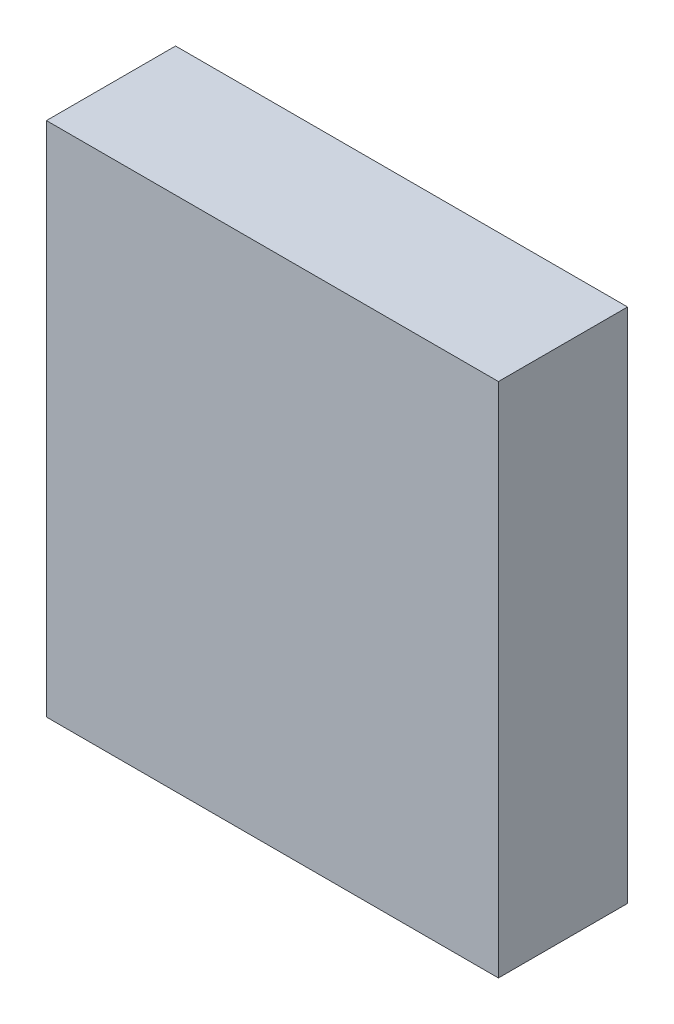
ISO-10303-21;
HEADER;
FILE_DESCRIPTION(('STEP AP214'),'2;1');
FILE_NAME('part.step','',(''),(''),'','','');
FILE_SCHEMA(('AUTOMOTIVE_DESIGN { 1 0 10303 214 1 1 1 1 }'));
ENDSEC;
DATA;
#1=APPLICATION_CONTEXT('core data for automotive mechanical design processes');
#2=APPLICATION_PROTOCOL_DEFINITION('international standard','automotive_design',2000,#1);
#3=PRODUCT_CONTEXT('',#1,'mechanical');
#4=PRODUCT('Part','Part','',(#3));
#5=PRODUCT_RELATED_PRODUCT_CATEGORY('part','',(#4));
#6=PRODUCT_DEFINITION_FORMATION('','',#4);
#7=PRODUCT_DEFINITION_CONTEXT('part definition',#1,'design');
#8=PRODUCT_DEFINITION('design','',#6,#7);
#9=PRODUCT_DEFINITION_SHAPE('','',#8);
#10=(LENGTH_UNIT() NAMED_UNIT(*) SI_UNIT(.MILLI.,.METRE.));
#11=(NAMED_UNIT(*) PLANE_ANGLE_UNIT() SI_UNIT($,.RADIAN.));
#12=(NAMED_UNIT(*) SI_UNIT($,.STERADIAN.) SOLID_ANGLE_UNIT());
#13=UNCERTAINTY_MEASURE_WITH_UNIT(LENGTH_MEASURE(1.E-05),#10,'distance_accuracy_value','');
#14=(GEOMETRIC_REPRESENTATION_CONTEXT(3) GLOBAL_UNCERTAINTY_ASSIGNED_CONTEXT((#13)) GLOBAL_UNIT_ASSIGNED_CONTEXT((#10,
#11,#12)) REPRESENTATION_CONTEXT('',''));
#15=CARTESIAN_POINT('',(0.,0.,0.));
#16=DIRECTION('',(0.,0.,1.));
#17=DIRECTION('',(1.,0.,0.));
#18=AXIS2_PLACEMENT_3D('',#15,#16,#17);
#19=CARTESIAN_POINT('',(0.,0.,10.));
#20=DIRECTION('',(1.,0.,0.));
#21=DIRECTION('',(0.,0.,-1.));
#22=AXIS2_PLACEMENT_3D('',#19,#20,#21);
#23=PLANE('',#22);
#24=DIRECTION('',(0.,-1.,0.));
#25=VECTOR('',#24,1.);
#26=CARTESIAN_POINT('',(0.,0.,0.));
#27=LINE('',#26,#25);
#28=CARTESIAN_POINT('',(0.,40.,0.));
#29=VERTEX_POINT('',#28);
#30=CARTESIAN_POINT('',(0.,0.,0.));
#31=VERTEX_POINT('',#30);
#32=EDGE_CURVE('E107',#29,#31,#27,.T.);
#33=ORIENTED_EDGE('',*,*,#32,.T.);
#34=DIRECTION('',(0.,0.,-1.));
#35=VECTOR('',#34,1.);
#36=CARTESIAN_POINT('',(0.,0.,10.));
#37=LINE('',#36,#35);
#38=CARTESIAN_POINT('',(0.,0.,10.));
#39=VERTEX_POINT('',#38);
#40=EDGE_CURVE('E11',#39,#31,#37,.T.);
#41=ORIENTED_EDGE('',*,*,#40,.F.);
#42=DIRECTION('',(0.,-1.,0.));
#43=VECTOR('',#42,1.);
#44=CARTESIAN_POINT('',(0.,0.,10.));
#45=LINE('',#44,#43);
#46=CARTESIAN_POINT('',(0.,40.,10.));
#47=VERTEX_POINT('',#46);
#48=EDGE_CURVE('E91',#47,#39,#45,.T.);
#49=ORIENTED_EDGE('',*,*,#48,.F.);
#50=DIRECTION('',(0.,0.,-1.));
#51=VECTOR('',#50,1.);
#52=CARTESIAN_POINT('',(0.,40.,10.));
#53=LINE('',#52,#51);
#54=EDGE_CURVE('E103',#47,#29,#53,.T.);
#55=ORIENTED_EDGE('',*,*,#54,.T.);
#56=EDGE_LOOP('',(#33,#41,#49,#55));
#57=FACE_BOUND('',#56,.T.);
#58=ADVANCED_FACE('F39',(#57),#23,.F.);
#59=CARTESIAN_POINT('',(0.,0.,10.));
#60=DIRECTION('',(0.,1.,0.));
#61=DIRECTION('',(-1.,0.,0.));
#62=AXIS2_PLACEMENT_3D('',#59,#60,#61);
#63=PLANE('',#62);
#64=DIRECTION('',(1.,0.,0.));
#65=VECTOR('',#64,1.);
#66=CARTESIAN_POINT('',(0.,0.,0.));
#67=LINE('',#66,#65);
#68=CARTESIAN_POINT('',(35.,0.,0.));
#69=VERTEX_POINT('',#68);
#70=EDGE_CURVE('E96',#31,#69,#67,.T.);
#71=ORIENTED_EDGE('',*,*,#70,.T.);
#72=DIRECTION('',(0.,0.,-1.));
#73=VECTOR('',#72,1.);
#74=CARTESIAN_POINT('',(35.,0.,10.));
#75=LINE('',#74,#73);
#76=CARTESIAN_POINT('',(35.,0.,10.));
#77=VERTEX_POINT('',#76);
#78=EDGE_CURVE('E48',#77,#69,#75,.T.);
#79=ORIENTED_EDGE('',*,*,#78,.F.);
#80=DIRECTION('',(1.,0.,0.));
#81=VECTOR('',#80,1.);
#82=CARTESIAN_POINT('',(0.,0.,10.));
#83=LINE('',#82,#81);
#84=EDGE_CURVE('E86',#39,#77,#83,.T.);
#85=ORIENTED_EDGE('',*,*,#84,.F.);
#86=ORIENTED_EDGE('',*,*,#40,.T.);
#87=EDGE_LOOP('',(#71,#79,#85,#86));
#88=FACE_BOUND('',#87,.T.);
#89=ADVANCED_FACE('F95',(#88),#63,.F.);
#90=CARTESIAN_POINT('',(35.,0.,10.));
#91=DIRECTION('',(-1.,0.,0.));
#92=DIRECTION('',(0.,-1.,0.));
#93=AXIS2_PLACEMENT_3D('',#90,#91,#92);
#94=PLANE('',#93);
#95=DIRECTION('',(0.,1.,0.));
#96=VECTOR('',#95,1.);
#97=CARTESIAN_POINT('',(35.,0.,0.));
#98=LINE('',#97,#96);
#99=CARTESIAN_POINT('',(35.,40.,0.));
#100=VERTEX_POINT('',#99);
#101=EDGE_CURVE('E73',#69,#100,#98,.T.);
#102=ORIENTED_EDGE('',*,*,#101,.T.);
#103=DIRECTION('',(0.,0.,-1.));
#104=VECTOR('',#103,1.);
#105=CARTESIAN_POINT('',(35.,40.,10.));
#106=LINE('',#105,#104);
#107=CARTESIAN_POINT('',(35.,40.,10.));
#108=VERTEX_POINT('',#107);
#109=EDGE_CURVE('E98',#108,#100,#106,.T.);
#110=ORIENTED_EDGE('',*,*,#109,.F.);
#111=DIRECTION('',(0.,1.,0.));
#112=VECTOR('',#111,1.);
#113=CARTESIAN_POINT('',(35.,0.,10.));
#114=LINE('',#113,#112);
#115=EDGE_CURVE('E89',#77,#108,#114,.T.);
#116=ORIENTED_EDGE('',*,*,#115,.F.);
#117=ORIENTED_EDGE('',*,*,#78,.T.);
#118=EDGE_LOOP('',(#102,#110,#116,#117));
#119=FACE_BOUND('',#118,.T.);
#120=ADVANCED_FACE('F99',(#119),#94,.F.);
#121=CARTESIAN_POINT('',(0.,40.,10.));
#122=DIRECTION('',(0.,-1.,0.));
#123=DIRECTION('',(1.,0.,0.));
#124=AXIS2_PLACEMENT_3D('',#121,#122,#123);
#125=PLANE('',#124);
#126=DIRECTION('',(-1.,0.,0.));
#127=VECTOR('',#126,1.);
#128=CARTESIAN_POINT('',(0.,40.,0.));
#129=LINE('',#128,#127);
#130=EDGE_CURVE('E79',#100,#29,#129,.T.);
#131=ORIENTED_EDGE('',*,*,#130,.T.);
#132=ORIENTED_EDGE('',*,*,#54,.F.);
#133=DIRECTION('',(-1.,0.,0.));
#134=VECTOR('',#133,1.);
#135=CARTESIAN_POINT('',(0.,40.,10.));
#136=LINE('',#135,#134);
#137=EDGE_CURVE('E56',#108,#47,#136,.T.);
#138=ORIENTED_EDGE('',*,*,#137,.F.);
#139=ORIENTED_EDGE('',*,*,#109,.T.);
#140=EDGE_LOOP('',(#131,#132,#138,#139));
#141=FACE_BOUND('',#140,.T.);
#142=ADVANCED_FACE('F120',(#141),#125,.F.);
#143=CARTESIAN_POINT('',(0.,0.,10.));
#144=DIRECTION('',(0.,0.,-1.));
#145=DIRECTION('',(-1.,0.,0.));
#146=AXIS2_PLACEMENT_3D('',#143,#144,#145);
#147=PLANE('',#146);
#148=ORIENTED_EDGE('',*,*,#48,.T.);
#149=ORIENTED_EDGE('',*,*,#84,.T.);
#150=ORIENTED_EDGE('',*,*,#115,.T.);
#151=ORIENTED_EDGE('',*,*,#137,.T.);
#152=EDGE_LOOP('',(#148,#149,#150,#151));
#153=FACE_BOUND('',#152,.T.);
#154=ADVANCED_FACE('F87',(#153),#147,.F.);
#155=CARTESIAN_POINT('',(0.,0.,0.));
#156=DIRECTION('',(0.,0.,-1.));
#157=DIRECTION('',(-1.,0.,0.));
#158=AXIS2_PLACEMENT_3D('',#155,#156,#157);
#159=PLANE('',#158);
#160=ORIENTED_EDGE('',*,*,#32,.F.);
#161=ORIENTED_EDGE('',*,*,#130,.F.);
#162=ORIENTED_EDGE('',*,*,#101,.F.);
#163=ORIENTED_EDGE('',*,*,#70,.F.);
#164=EDGE_LOOP('',(#160,#161,#162,#163));
#165=FACE_BOUND('',#164,.T.);
#166=ADVANCED_FACE('F123',(#165),#159,.T.);
#167=CLOSED_SHELL('',(#58,#89,#120,#142,#154,#166));
#168=MANIFOLD_SOLID_BREP('B2',#167);
#169=ADVANCED_BREP_SHAPE_REPRESENTATION('',(#18,#168),#14);
#170=SHAPE_DEFINITION_REPRESENTATION(#9,#169);
ENDSEC;
END-ISO-10303-21;
